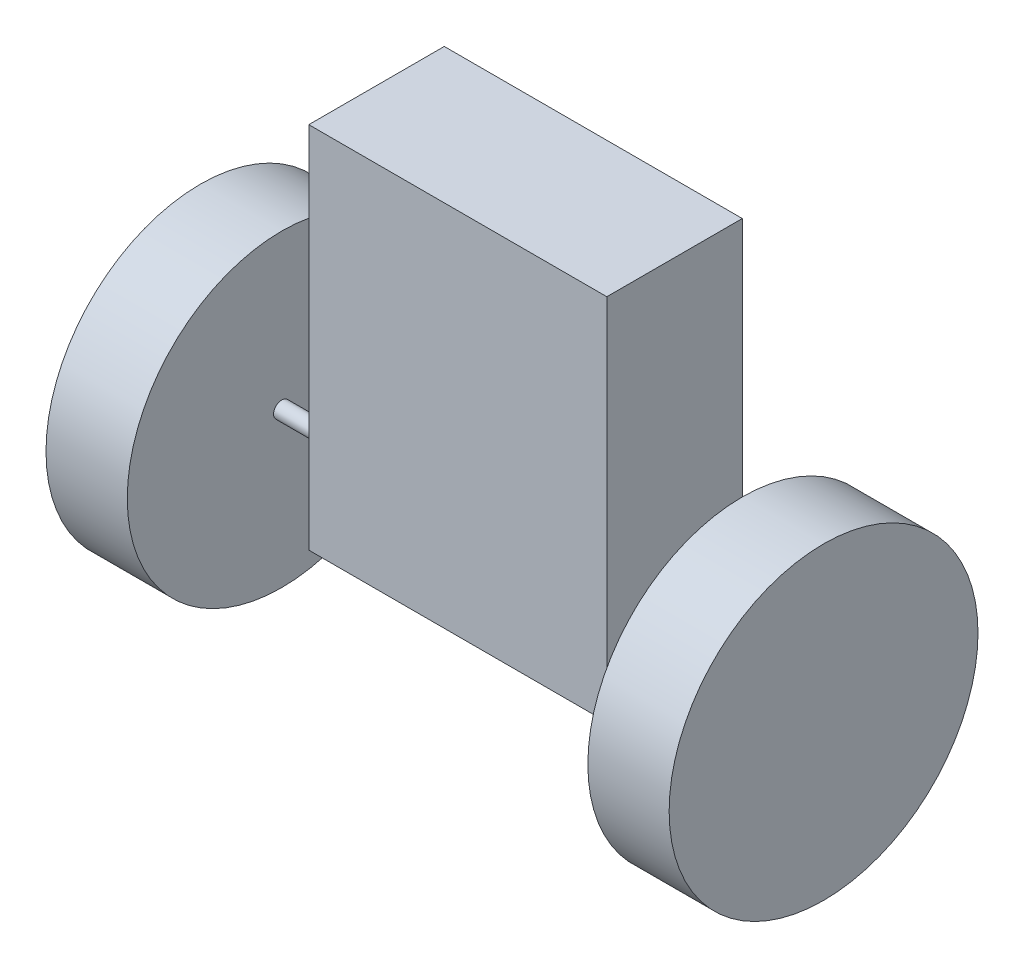
ISO-10303-21;
HEADER;
FILE_DESCRIPTION(('STEP AP214'),'2;1');
FILE_NAME('part.step','',(''),(''),'','','');
FILE_SCHEMA(('AUTOMOTIVE_DESIGN { 1 0 10303 214 1 1 1 1 }'));
ENDSEC;
DATA;
#1=APPLICATION_CONTEXT('core data for automotive mechanical design processes');
#2=APPLICATION_PROTOCOL_DEFINITION('international standard','automotive_design',2000,#1);
#3=PRODUCT_CONTEXT('',#1,'mechanical');
#4=PRODUCT('Part','Part','',(#3));
#5=PRODUCT_RELATED_PRODUCT_CATEGORY('part','',(#4));
#6=PRODUCT_DEFINITION_FORMATION('','',#4);
#7=PRODUCT_DEFINITION_CONTEXT('part definition',#1,'design');
#8=PRODUCT_DEFINITION('design','',#6,#7);
#9=PRODUCT_DEFINITION_SHAPE('','',#8);
#10=(LENGTH_UNIT() NAMED_UNIT(*) SI_UNIT(.MILLI.,.METRE.));
#11=(NAMED_UNIT(*) PLANE_ANGLE_UNIT() SI_UNIT($,.RADIAN.));
#12=(NAMED_UNIT(*) SI_UNIT($,.STERADIAN.) SOLID_ANGLE_UNIT());
#13=UNCERTAINTY_MEASURE_WITH_UNIT(LENGTH_MEASURE(1.E-05),#10,'distance_accuracy_value','');
#14=(GEOMETRIC_REPRESENTATION_CONTEXT(3) GLOBAL_UNCERTAINTY_ASSIGNED_CONTEXT((#13)) GLOBAL_UNIT_ASSIGNED_CONTEXT((#10,
#11,#12)) REPRESENTATION_CONTEXT('',''));
#15=CARTESIAN_POINT('',(0.,0.,0.));
#16=DIRECTION('',(0.,0.,1.));
#17=DIRECTION('',(1.,0.,0.));
#18=AXIS2_PLACEMENT_3D('',#15,#16,#17);
#19=CARTESIAN_POINT('',(27.5,-34.,25.));
#20=DIRECTION('',(-1.,0.,0.));
#21=DIRECTION('',(0.,0.,1.));
#22=AXIS2_PLACEMENT_3D('',#19,#20,#21);
#23=PLANE('',#22);
#24=CARTESIAN_POINT('',(27.5,-24.,15.));
#25=DIRECTION('',(-1.,0.,0.));
#26=DIRECTION('',(0.,0.,1.));
#27=AXIS2_PLACEMENT_3D('',#24,#25,#26);
#28=CIRCLE('',#27,1.5);
#29=CARTESIAN_POINT('',(27.5,-24.,16.5));
#30=VERTEX_POINT('',#29);
#31=EDGE_CURVE('E205',#30,#30,#28,.T.);
#32=ORIENTED_EDGE('',*,*,#31,.T.);
#33=EDGE_LOOP('',(#32));
#34=FACE_BOUND('',#33,.T.);
#35=DIRECTION('',(0.,0.,-1.));
#36=VECTOR('',#35,1.);
#37=CARTESIAN_POINT('',(27.5,-28.4934610358261,2.));
#38=LINE('',#37,#36);
#39=CARTESIAN_POINT('',(27.5,-28.4934610358261,2.));
#40=VERTEX_POINT('',#39);
#41=CARTESIAN_POINT('',(27.5,-28.4934610358261,0.));
#42=VERTEX_POINT('',#41);
#43=EDGE_CURVE('E52',#40,#42,#38,.T.);
#44=ORIENTED_EDGE('',*,*,#43,.F.);
#45=DIRECTION('',(0.,-1.,0.));
#46=VECTOR('',#45,1.);
#47=CARTESIAN_POINT('',(27.5,-28.4934610358261,2.));
#48=LINE('',#47,#46);
#49=CARTESIAN_POINT('',(27.5,-23.4934610358261,2.));
#50=VERTEX_POINT('',#49);
#51=EDGE_CURVE('E47',#50,#40,#48,.T.);
#52=ORIENTED_EDGE('',*,*,#51,.F.);
#53=DIRECTION('',(0.,0.,-1.));
#54=VECTOR('',#53,1.);
#55=CARTESIAN_POINT('',(27.5,-23.4934610358261,2.));
#56=LINE('',#55,#54);
#57=CARTESIAN_POINT('',(27.5,-23.4934610358261,0.));
#58=VERTEX_POINT('',#57);
#59=EDGE_CURVE('E140',#50,#58,#56,.T.);
#60=ORIENTED_EDGE('',*,*,#59,.T.);
#61=DIRECTION('',(0.,1.,0.));
#62=VECTOR('',#61,1.);
#63=CARTESIAN_POINT('',(27.5,-34.,0.));
#64=LINE('',#63,#62);
#65=CARTESIAN_POINT('',(27.5,34.,0.));
#66=VERTEX_POINT('',#65);
#67=EDGE_CURVE('E208',#58,#66,#64,.T.);
#68=ORIENTED_EDGE('',*,*,#67,.T.);
#69=DIRECTION('',(0.,0.,-1.));
#70=VECTOR('',#69,1.);
#71=CARTESIAN_POINT('',(27.5,34.,25.));
#72=LINE('',#71,#70);
#73=CARTESIAN_POINT('',(27.5,34.,25.));
#74=VERTEX_POINT('',#73);
#75=EDGE_CURVE('E236',#74,#66,#72,.T.);
#76=ORIENTED_EDGE('',*,*,#75,.F.);
#77=DIRECTION('',(0.,1.,0.));
#78=VECTOR('',#77,1.);
#79=CARTESIAN_POINT('',(27.5,-34.,25.));
#80=LINE('',#79,#78);
#81=CARTESIAN_POINT('',(27.5,-34.,25.));
#82=VERTEX_POINT('',#81);
#83=EDGE_CURVE('E209',#82,#74,#80,.T.);
#84=ORIENTED_EDGE('',*,*,#83,.F.);
#85=DIRECTION('',(0.,0.,-1.));
#86=VECTOR('',#85,1.);
#87=CARTESIAN_POINT('',(27.5,-34.,25.));
#88=LINE('',#87,#86);
#89=CARTESIAN_POINT('',(27.5,-34.,0.));
#90=VERTEX_POINT('',#89);
#91=EDGE_CURVE('E219',#82,#90,#88,.T.);
#92=ORIENTED_EDGE('',*,*,#91,.T.);
#93=EDGE_CURVE('E220',#90,#42,#64,.T.);
#94=ORIENTED_EDGE('',*,*,#93,.T.);
#95=EDGE_LOOP('',(#44,#52,#60,#68,#76,#84,#92,#94));
#96=FACE_BOUND('',#95,.T.);
#97=ADVANCED_FACE('F32',(#34,#96),#23,.F.);
#98=CARTESIAN_POINT('',(47.5,-24.,15.));
#99=DIRECTION('',(-1.,0.,0.));
#100=DIRECTION('',(0.,0.,1.));
#101=AXIS2_PLACEMENT_3D('',#98,#99,#100);
#102=CYLINDRICAL_SURFACE('',#101,1.5);
#103=ORIENTED_EDGE('',*,*,#31,.F.);
#104=EDGE_LOOP('',(#103));
#105=FACE_BOUND('',#104,.T.);
#106=CARTESIAN_POINT('',(42.5,-24.,15.));
#107=DIRECTION('',(1.,0.,0.));
#108=DIRECTION('',(0.,0.,-1.));
#109=AXIS2_PLACEMENT_3D('',#106,#107,#108);
#110=CIRCLE('',#109,1.5);
#111=CARTESIAN_POINT('',(42.5,-24.,13.5));
#112=VERTEX_POINT('',#111);
#113=EDGE_CURVE('E35',#112,#112,#110,.F.);
#114=ORIENTED_EDGE('',*,*,#113,.T.);
#115=EDGE_LOOP('',(#114));
#116=FACE_BOUND('',#115,.T.);
#117=ADVANCED_FACE('F256',(#105,#116),#102,.T.);
#118=CARTESIAN_POINT('',(-47.5,-24.,15.));
#119=DIRECTION('',(1.,0.,0.));
#120=DIRECTION('',(0.,0.,-1.));
#121=AXIS2_PLACEMENT_3D('',#118,#119,#120);
#122=CYLINDRICAL_SURFACE('',#121,1.5);
#123=CARTESIAN_POINT('',(-27.5,-24.,15.));
#124=DIRECTION('',(1.,0.,0.));
#125=DIRECTION('',(0.,0.,-1.));
#126=AXIS2_PLACEMENT_3D('',#123,#124,#125);
#127=CIRCLE('',#126,1.5);
#128=CARTESIAN_POINT('',(-27.5,-24.,13.5));
#129=VERTEX_POINT('',#128);
#130=EDGE_CURVE('E40',#129,#129,#127,.F.);
#131=ORIENTED_EDGE('',*,*,#130,.T.);
#132=EDGE_LOOP('',(#131));
#133=FACE_BOUND('',#132,.T.);
#134=CARTESIAN_POINT('',(-42.5,-24.,15.));
#135=DIRECTION('',(-1.,0.,0.));
#136=DIRECTION('',(0.,0.,1.));
#137=AXIS2_PLACEMENT_3D('',#134,#135,#136);
#138=CIRCLE('',#137,1.5);
#139=CARTESIAN_POINT('',(-42.5,-24.,16.5));
#140=VERTEX_POINT('',#139);
#141=EDGE_CURVE('E11',#140,#140,#138,.T.);
#142=ORIENTED_EDGE('',*,*,#141,.F.);
#143=EDGE_LOOP('',(#142));
#144=FACE_BOUND('',#143,.T.);
#145=ADVANCED_FACE('F242',(#133,#144),#122,.T.);
#146=CARTESIAN_POINT('',(-27.5,-34.,25.));
#147=DIRECTION('',(1.,0.,0.));
#148=DIRECTION('',(0.,0.,-1.));
#149=AXIS2_PLACEMENT_3D('',#146,#147,#148);
#150=PLANE('',#149);
#151=DIRECTION('',(0.,-1.,0.));
#152=VECTOR('',#151,1.);
#153=CARTESIAN_POINT('',(-27.5,-34.,0.));
#154=LINE('',#153,#152);
#155=CARTESIAN_POINT('',(-27.5,34.,0.));
#156=VERTEX_POINT('',#155);
#157=CARTESIAN_POINT('',(-27.5,-23.4934610358261,0.));
#158=VERTEX_POINT('',#157);
#159=EDGE_CURVE('E225',#156,#158,#154,.T.);
#160=ORIENTED_EDGE('',*,*,#159,.T.);
#161=DIRECTION('',(0.,0.,-1.));
#162=VECTOR('',#161,1.);
#163=CARTESIAN_POINT('',(-27.5,-23.4934610358261,2.));
#164=LINE('',#163,#162);
#165=CARTESIAN_POINT('',(-27.5,-23.4934610358261,2.));
#166=VERTEX_POINT('',#165);
#167=EDGE_CURVE('E184',#166,#158,#164,.T.);
#168=ORIENTED_EDGE('',*,*,#167,.F.);
#169=DIRECTION('',(0.,-1.,0.));
#170=VECTOR('',#169,1.);
#171=CARTESIAN_POINT('',(-27.5,-28.4934610358261,2.));
#172=LINE('',#171,#170);
#173=CARTESIAN_POINT('',(-27.5,-28.4934610358261,2.));
#174=VERTEX_POINT('',#173);
#175=EDGE_CURVE('E164',#166,#174,#172,.T.);
#176=ORIENTED_EDGE('',*,*,#175,.T.);
#177=DIRECTION('',(0.,0.,-1.));
#178=VECTOR('',#177,1.);
#179=CARTESIAN_POINT('',(-27.5,-28.4934610358261,2.));
#180=LINE('',#179,#178);
#181=CARTESIAN_POINT('',(-27.5,-28.4934610358261,0.));
#182=VERTEX_POINT('',#181);
#183=EDGE_CURVE('E176',#174,#182,#180,.T.);
#184=ORIENTED_EDGE('',*,*,#183,.T.);
#185=CARTESIAN_POINT('',(-27.5,-34.,0.));
#186=VERTEX_POINT('',#185);
#187=EDGE_CURVE('E224',#182,#186,#154,.T.);
#188=ORIENTED_EDGE('',*,*,#187,.T.);
#189=DIRECTION('',(0.,0.,-1.));
#190=VECTOR('',#189,1.);
#191=CARTESIAN_POINT('',(-27.5,-34.,25.));
#192=LINE('',#191,#190);
#193=CARTESIAN_POINT('',(-27.5,-34.,25.));
#194=VERTEX_POINT('',#193);
#195=EDGE_CURVE('E230',#194,#186,#192,.T.);
#196=ORIENTED_EDGE('',*,*,#195,.F.);
#197=DIRECTION('',(0.,-1.,0.));
#198=VECTOR('',#197,1.);
#199=CARTESIAN_POINT('',(-27.5,-34.,25.));
#200=LINE('',#199,#198);
#201=CARTESIAN_POINT('',(-27.5,34.,25.));
#202=VERTEX_POINT('',#201);
#203=EDGE_CURVE('E215',#202,#194,#200,.T.);
#204=ORIENTED_EDGE('',*,*,#203,.F.);
#205=DIRECTION('',(0.,0.,-1.));
#206=VECTOR('',#205,1.);
#207=CARTESIAN_POINT('',(-27.5,34.,25.));
#208=LINE('',#207,#206);
#209=EDGE_CURVE('E233',#202,#156,#208,.T.);
#210=ORIENTED_EDGE('',*,*,#209,.T.);
#211=EDGE_LOOP('',(#160,#168,#176,#184,#188,#196,#204,#210));
#212=FACE_BOUND('',#211,.T.);
#213=ORIENTED_EDGE('',*,*,#130,.F.);
#214=EDGE_LOOP('',(#213));
#215=FACE_BOUND('',#214,.T.);
#216=ADVANCED_FACE('F245',(#212,#215),#150,.F.);
#217=CARTESIAN_POINT('',(-27.5,34.,25.));
#218=DIRECTION('',(0.,-1.,0.));
#219=DIRECTION('',(0.,0.,-1.));
#220=AXIS2_PLACEMENT_3D('',#217,#218,#219);
#221=PLANE('',#220);
#222=DIRECTION('',(-1.,0.,0.));
#223=VECTOR('',#222,1.);
#224=CARTESIAN_POINT('',(-27.5,34.,0.));
#225=LINE('',#224,#223);
#226=EDGE_CURVE('E222',#66,#156,#225,.T.);
#227=ORIENTED_EDGE('',*,*,#226,.T.);
#228=ORIENTED_EDGE('',*,*,#209,.F.);
#229=DIRECTION('',(-1.,0.,0.));
#230=VECTOR('',#229,1.);
#231=CARTESIAN_POINT('',(-27.5,34.,25.));
#232=LINE('',#231,#230);
#233=EDGE_CURVE('E212',#74,#202,#232,.T.);
#234=ORIENTED_EDGE('',*,*,#233,.F.);
#235=ORIENTED_EDGE('',*,*,#75,.T.);
#236=EDGE_LOOP('',(#227,#228,#234,#235));
#237=FACE_BOUND('',#236,.T.);
#238=ADVANCED_FACE('F247',(#237),#221,.F.);
#239=CARTESIAN_POINT('',(-27.5,-34.,25.));
#240=DIRECTION('',(0.,1.,0.));
#241=DIRECTION('',(0.,0.,1.));
#242=AXIS2_PLACEMENT_3D('',#239,#240,#241);
#243=PLANE('',#242);
#244=DIRECTION('',(1.,0.,0.));
#245=VECTOR('',#244,1.);
#246=CARTESIAN_POINT('',(-27.5,-34.,0.));
#247=LINE('',#246,#245);
#248=EDGE_CURVE('E213',#186,#90,#247,.T.);
#249=ORIENTED_EDGE('',*,*,#248,.T.);
#250=ORIENTED_EDGE('',*,*,#91,.F.);
#251=DIRECTION('',(1.,0.,0.));
#252=VECTOR('',#251,1.);
#253=CARTESIAN_POINT('',(-27.5,-34.,25.));
#254=LINE('',#253,#252);
#255=EDGE_CURVE('E217',#194,#82,#254,.T.);
#256=ORIENTED_EDGE('',*,*,#255,.F.);
#257=ORIENTED_EDGE('',*,*,#195,.T.);
#258=EDGE_LOOP('',(#249,#250,#256,#257));
#259=FACE_BOUND('',#258,.T.);
#260=ADVANCED_FACE('F254',(#259),#243,.F.);
#261=CARTESIAN_POINT('',(0.,0.,25.));
#262=DIRECTION('',(0.,0.,-1.));
#263=DIRECTION('',(-1.,0.,0.));
#264=AXIS2_PLACEMENT_3D('',#261,#262,#263);
#265=PLANE('',#264);
#266=ORIENTED_EDGE('',*,*,#83,.T.);
#267=ORIENTED_EDGE('',*,*,#233,.T.);
#268=ORIENTED_EDGE('',*,*,#203,.T.);
#269=ORIENTED_EDGE('',*,*,#255,.T.);
#270=EDGE_LOOP('',(#266,#267,#268,#269));
#271=FACE_BOUND('',#270,.T.);
#272=ADVANCED_FACE('F310',(#271),#265,.F.);
#273=CARTESIAN_POINT('',(0.,0.,0.));
#274=DIRECTION('',(0.,0.,-1.));
#275=DIRECTION('',(-1.,0.,0.));
#276=AXIS2_PLACEMENT_3D('',#273,#274,#275);
#277=PLANE('',#276);
#278=CARTESIAN_POINT('',(30.,-25.9934610358261,0.));
#279=DIRECTION('',(0.,0.,-1.));
#280=DIRECTION('',(-1.,0.,0.));
#281=AXIS2_PLACEMENT_3D('',#278,#279,#280);
#282=CIRCLE('',#281,1.69999999999999);
#283=CARTESIAN_POINT('',(28.3,-25.9934610358261,0.));
#284=VERTEX_POINT('',#283);
#285=EDGE_CURVE('E431',#284,#284,#282,.T.);
#286=ORIENTED_EDGE('',*,*,#285,.F.);
#287=EDGE_LOOP('',(#286));
#288=FACE_BOUND('',#287,.T.);
#289=CARTESIAN_POINT('',(-30.,-25.9934610358261,0.));
#290=DIRECTION('',(0.,0.,-1.));
#291=DIRECTION('',(-1.,0.,0.));
#292=AXIS2_PLACEMENT_3D('',#289,#290,#291);
#293=CIRCLE('',#292,1.69999999999999);
#294=CARTESIAN_POINT('',(-31.7,-25.9934610358261,0.));
#295=VERTEX_POINT('',#294);
#296=EDGE_CURVE('E155',#295,#295,#293,.T.);
#297=ORIENTED_EDGE('',*,*,#296,.F.);
#298=EDGE_LOOP('',(#297));
#299=FACE_BOUND('',#298,.T.);
#300=ORIENTED_EDGE('',*,*,#93,.F.);
#301=ORIENTED_EDGE('',*,*,#248,.F.);
#302=ORIENTED_EDGE('',*,*,#187,.F.);
#303=DIRECTION('',(-1.,0.,0.));
#304=VECTOR('',#303,1.);
#305=CARTESIAN_POINT('',(-32.5,-28.4934610358261,0.));
#306=LINE('',#305,#304);
#307=CARTESIAN_POINT('',(-32.5,-28.4934610358261,0.));
#308=VERTEX_POINT('',#307);
#309=EDGE_CURVE('E163',#182,#308,#306,.T.);
#310=ORIENTED_EDGE('',*,*,#309,.T.);
#311=DIRECTION('',(0.,1.,0.));
#312=VECTOR('',#311,1.);
#313=CARTESIAN_POINT('',(-32.5,-23.4934610358261,0.));
#314=LINE('',#313,#312);
#315=CARTESIAN_POINT('',(-32.5,-23.4934610358261,0.));
#316=VERTEX_POINT('',#315);
#317=EDGE_CURVE('E179',#308,#316,#314,.T.);
#318=ORIENTED_EDGE('',*,*,#317,.T.);
#319=DIRECTION('',(1.,0.,0.));
#320=VECTOR('',#319,1.);
#321=CARTESIAN_POINT('',(-27.5,-23.4934610358261,0.));
#322=LINE('',#321,#320);
#323=EDGE_CURVE('E167',#316,#158,#322,.T.);
#324=ORIENTED_EDGE('',*,*,#323,.T.);
#325=ORIENTED_EDGE('',*,*,#159,.F.);
#326=ORIENTED_EDGE('',*,*,#226,.F.);
#327=ORIENTED_EDGE('',*,*,#67,.F.);
#328=DIRECTION('',(-1.,0.,0.));
#329=VECTOR('',#328,1.);
#330=CARTESIAN_POINT('',(27.5,-23.4934610358261,0.));
#331=LINE('',#330,#329);
#332=CARTESIAN_POINT('',(32.5,-23.4934610358261,0.));
#333=VERTEX_POINT('',#332);
#334=EDGE_CURVE('E149',#333,#58,#331,.T.);
#335=ORIENTED_EDGE('',*,*,#334,.F.);
#336=DIRECTION('',(0.,1.,0.));
#337=VECTOR('',#336,1.);
#338=CARTESIAN_POINT('',(32.5,-23.4934610358261,0.));
#339=LINE('',#338,#337);
#340=CARTESIAN_POINT('',(32.5,-28.4934610358261,0.));
#341=VERTEX_POINT('',#340);
#342=EDGE_CURVE('E135',#341,#333,#339,.T.);
#343=ORIENTED_EDGE('',*,*,#342,.F.);
#344=DIRECTION('',(1.,0.,0.));
#345=VECTOR('',#344,1.);
#346=CARTESIAN_POINT('',(32.5,-28.4934610358261,0.));
#347=LINE('',#346,#345);
#348=EDGE_CURVE('E144',#42,#341,#347,.T.);
#349=ORIENTED_EDGE('',*,*,#348,.F.);
#350=EDGE_LOOP('',(#300,#301,#302,#310,#318,#324,#325,#326,#327,#335,#343,#349));
#351=FACE_BOUND('',#350,.T.);
#352=ADVANCED_FACE('F305',(#288,#299,#351),#277,.T.);
#353=CARTESIAN_POINT('',(-42.5,-24.,15.));
#354=DIRECTION('',(-1.,0.,0.));
#355=DIRECTION('',(0.,0.,1.));
#356=AXIS2_PLACEMENT_3D('',#353,#354,#355);
#357=PLANE('',#356);
#358=CARTESIAN_POINT('',(-42.5,-24.,15.));
#359=DIRECTION('',(-1.,0.,0.));
#360=DIRECTION('',(0.,0.,1.));
#361=AXIS2_PLACEMENT_3D('',#358,#359,#360);
#362=CIRCLE('',#361,28.5);
#363=CARTESIAN_POINT('',(-42.5,-24.,43.5));
#364=VERTEX_POINT('',#363);
#365=EDGE_CURVE('E202',#364,#364,#362,.T.);
#366=ORIENTED_EDGE('',*,*,#365,.F.);
#367=EDGE_LOOP('',(#366));
#368=FACE_BOUND('',#367,.T.);
#369=ORIENTED_EDGE('',*,*,#141,.T.);
#370=EDGE_LOOP('',(#369));
#371=FACE_BOUND('',#370,.T.);
#372=ADVANCED_FACE('F302',(#368,#371),#357,.F.);
#373=CARTESIAN_POINT('',(-42.5,-24.,15.));
#374=DIRECTION('',(-1.,0.,0.));
#375=DIRECTION('',(0.,0.,1.));
#376=AXIS2_PLACEMENT_3D('',#373,#374,#375);
#377=CYLINDRICAL_SURFACE('',#376,28.5);
#378=ORIENTED_EDGE('',*,*,#365,.T.);
#379=EDGE_LOOP('',(#378));
#380=FACE_BOUND('',#379,.T.);
#381=CARTESIAN_POINT('',(-57.5,-24.,15.));
#382=DIRECTION('',(-1.,0.,0.));
#383=DIRECTION('',(0.,0.,1.));
#384=AXIS2_PLACEMENT_3D('',#381,#382,#383);
#385=CIRCLE('',#384,28.5);
#386=CARTESIAN_POINT('',(-57.5,-24.,43.5));
#387=VERTEX_POINT('',#386);
#388=EDGE_CURVE('E199',#387,#387,#385,.T.);
#389=ORIENTED_EDGE('',*,*,#388,.F.);
#390=EDGE_LOOP('',(#389));
#391=FACE_BOUND('',#390,.T.);
#392=ADVANCED_FACE('F300',(#380,#391),#377,.T.);
#393=CARTESIAN_POINT('',(-57.5,-24.,15.));
#394=DIRECTION('',(-1.,0.,0.));
#395=DIRECTION('',(0.,0.,1.));
#396=AXIS2_PLACEMENT_3D('',#393,#394,#395);
#397=PLANE('',#396);
#398=ORIENTED_EDGE('',*,*,#388,.T.);
#399=EDGE_LOOP('',(#398));
#400=FACE_BOUND('',#399,.T.);
#401=ADVANCED_FACE('F281',(#400),#397,.T.);
#402=CARTESIAN_POINT('',(42.5,-24.,15.));
#403=DIRECTION('',(1.,0.,0.));
#404=DIRECTION('',(0.,0.,-1.));
#405=AXIS2_PLACEMENT_3D('',#402,#403,#404);
#406=CYLINDRICAL_SURFACE('',#405,28.5);
#407=CARTESIAN_POINT('',(42.5,-24.,15.));
#408=DIRECTION('',(-1.,0.,0.));
#409=DIRECTION('',(0.,0.,1.));
#410=AXIS2_PLACEMENT_3D('',#407,#408,#409);
#411=CIRCLE('',#410,28.5);
#412=CARTESIAN_POINT('',(42.5,-24.,43.5));
#413=VERTEX_POINT('',#412);
#414=EDGE_CURVE('E196',#413,#413,#411,.T.);
#415=ORIENTED_EDGE('',*,*,#414,.F.);
#416=EDGE_LOOP('',(#415));
#417=FACE_BOUND('',#416,.T.);
#418=CARTESIAN_POINT('',(57.5,-24.,15.));
#419=DIRECTION('',(-1.,0.,0.));
#420=DIRECTION('',(0.,0.,1.));
#421=AXIS2_PLACEMENT_3D('',#418,#419,#420);
#422=CIRCLE('',#421,28.5);
#423=CARTESIAN_POINT('',(57.5,-24.,43.5));
#424=VERTEX_POINT('',#423);
#425=EDGE_CURVE('E187',#424,#424,#422,.T.);
#426=ORIENTED_EDGE('',*,*,#425,.T.);
#427=EDGE_LOOP('',(#426));
#428=FACE_BOUND('',#427,.T.);
#429=ADVANCED_FACE('F275',(#417,#428),#406,.T.);
#430=CARTESIAN_POINT('',(42.5,-24.,15.));
#431=DIRECTION('',(1.,0.,0.));
#432=DIRECTION('',(0.,0.,1.));
#433=AXIS2_PLACEMENT_3D('',#430,#431,#432);
#434=PLANE('',#433);
#435=ORIENTED_EDGE('',*,*,#113,.F.);
#436=EDGE_LOOP('',(#435));
#437=FACE_BOUND('',#436,.T.);
#438=ORIENTED_EDGE('',*,*,#414,.T.);
#439=EDGE_LOOP('',(#438));
#440=FACE_BOUND('',#439,.T.);
#441=ADVANCED_FACE('F271',(#437,#440),#434,.F.);
#442=CARTESIAN_POINT('',(57.5,-24.,15.));
#443=DIRECTION('',(1.,0.,0.));
#444=DIRECTION('',(0.,0.,1.));
#445=AXIS2_PLACEMENT_3D('',#442,#443,#444);
#446=PLANE('',#445);
#447=ORIENTED_EDGE('',*,*,#425,.F.);
#448=EDGE_LOOP('',(#447));
#449=FACE_BOUND('',#448,.T.);
#450=ADVANCED_FACE('F274',(#449),#446,.T.);
#451=CARTESIAN_POINT('',(-27.5,-23.4934610358261,2.));
#452=DIRECTION('',(0.,1.,0.));
#453=DIRECTION('',(-1.,0.,0.));
#454=AXIS2_PLACEMENT_3D('',#451,#452,#453);
#455=PLANE('',#454);
#456=ORIENTED_EDGE('',*,*,#323,.F.);
#457=DIRECTION('',(0.,0.,-1.));
#458=VECTOR('',#457,1.);
#459=CARTESIAN_POINT('',(-32.5,-23.4934610358261,2.));
#460=LINE('',#459,#458);
#461=CARTESIAN_POINT('',(-32.5,-23.4934610358261,2.));
#462=VERTEX_POINT('',#461);
#463=EDGE_CURVE('E188',#462,#316,#460,.T.);
#464=ORIENTED_EDGE('',*,*,#463,.F.);
#465=DIRECTION('',(1.,0.,0.));
#466=VECTOR('',#465,1.);
#467=CARTESIAN_POINT('',(-27.5,-23.4934610358261,2.));
#468=LINE('',#467,#466);
#469=EDGE_CURVE('E173',#462,#166,#468,.T.);
#470=ORIENTED_EDGE('',*,*,#469,.T.);
#471=ORIENTED_EDGE('',*,*,#167,.T.);
#472=EDGE_LOOP('',(#456,#464,#470,#471));
#473=FACE_BOUND('',#472,.T.);
#474=ADVANCED_FACE('F286',(#473),#455,.T.);
#475=CARTESIAN_POINT('',(-32.5,-23.4934610358261,2.));
#476=DIRECTION('',(-1.,0.,0.));
#477=DIRECTION('',(0.,-1.,0.));
#478=AXIS2_PLACEMENT_3D('',#475,#476,#477);
#479=PLANE('',#478);
#480=ORIENTED_EDGE('',*,*,#317,.F.);
#481=DIRECTION('',(0.,0.,-1.));
#482=VECTOR('',#481,1.);
#483=CARTESIAN_POINT('',(-32.5,-28.4934610358261,2.));
#484=LINE('',#483,#482);
#485=CARTESIAN_POINT('',(-32.5,-28.4934610358261,2.));
#486=VERTEX_POINT('',#485);
#487=EDGE_CURVE('E190',#486,#308,#484,.T.);
#488=ORIENTED_EDGE('',*,*,#487,.F.);
#489=DIRECTION('',(0.,1.,0.));
#490=VECTOR('',#489,1.);
#491=CARTESIAN_POINT('',(-32.5,-23.4934610358261,2.));
#492=LINE('',#491,#490);
#493=EDGE_CURVE('E170',#486,#462,#492,.T.);
#494=ORIENTED_EDGE('',*,*,#493,.T.);
#495=ORIENTED_EDGE('',*,*,#463,.T.);
#496=EDGE_LOOP('',(#480,#488,#494,#495));
#497=FACE_BOUND('',#496,.T.);
#498=ADVANCED_FACE('F291',(#497),#479,.T.);
#499=CARTESIAN_POINT('',(-32.5,-28.4934610358261,2.));
#500=DIRECTION('',(0.,-1.,0.));
#501=DIRECTION('',(0.,0.,-1.));
#502=AXIS2_PLACEMENT_3D('',#499,#500,#501);
#503=PLANE('',#502);
#504=ORIENTED_EDGE('',*,*,#309,.F.);
#505=ORIENTED_EDGE('',*,*,#183,.F.);
#506=DIRECTION('',(-1.,0.,0.));
#507=VECTOR('',#506,1.);
#508=CARTESIAN_POINT('',(-32.5,-28.4934610358261,2.));
#509=LINE('',#508,#507);
#510=EDGE_CURVE('E166',#174,#486,#509,.T.);
#511=ORIENTED_EDGE('',*,*,#510,.T.);
#512=ORIENTED_EDGE('',*,*,#487,.T.);
#513=EDGE_LOOP('',(#504,#505,#511,#512));
#514=FACE_BOUND('',#513,.T.);
#515=ADVANCED_FACE('F295',(#514),#503,.T.);
#516=CARTESIAN_POINT('',(0.,0.,2.));
#517=DIRECTION('',(0.,0.,1.));
#518=DIRECTION('',(1.,0.,0.));
#519=AXIS2_PLACEMENT_3D('',#516,#517,#518);
#520=PLANE('',#519);
#521=CARTESIAN_POINT('',(-30.,-25.9934610358261,2.));
#522=DIRECTION('',(0.,0.,1.));
#523=DIRECTION('',(1.,0.,0.));
#524=AXIS2_PLACEMENT_3D('',#521,#522,#523);
#525=CIRCLE('',#524,1.69999999999999);
#526=CARTESIAN_POINT('',(-28.3,-25.9934610358261,2.));
#527=VERTEX_POINT('',#526);
#528=EDGE_CURVE('E160',#527,#527,#525,.T.);
#529=ORIENTED_EDGE('',*,*,#528,.F.);
#530=EDGE_LOOP('',(#529));
#531=FACE_BOUND('',#530,.T.);
#532=ORIENTED_EDGE('',*,*,#175,.F.);
#533=ORIENTED_EDGE('',*,*,#469,.F.);
#534=ORIENTED_EDGE('',*,*,#493,.F.);
#535=ORIENTED_EDGE('',*,*,#510,.F.);
#536=EDGE_LOOP('',(#532,#533,#534,#535));
#537=FACE_BOUND('',#536,.T.);
#538=ADVANCED_FACE('F339',(#531,#537),#520,.T.);
#539=CARTESIAN_POINT('',(-30.,-25.9934610358261,0.));
#540=DIRECTION('',(0.,0.,-1.));
#541=DIRECTION('',(-1.,0.,0.));
#542=AXIS2_PLACEMENT_3D('',#539,#540,#541);
#543=CYLINDRICAL_SURFACE('',#542,1.69999999999999);
#544=ORIENTED_EDGE('',*,*,#528,.T.);
#545=EDGE_LOOP('',(#544));
#546=FACE_BOUND('',#545,.T.);
#547=ORIENTED_EDGE('',*,*,#296,.T.);
#548=EDGE_LOOP('',(#547));
#549=FACE_BOUND('',#548,.T.);
#550=ADVANCED_FACE('F332',(#546,#549),#543,.F.);
#551=CARTESIAN_POINT('',(32.5,-28.4934610358261,2.));
#552=DIRECTION('',(0.,1.,0.));
#553=DIRECTION('',(0.,0.,1.));
#554=AXIS2_PLACEMENT_3D('',#551,#552,#553);
#555=PLANE('',#554);
#556=ORIENTED_EDGE('',*,*,#348,.T.);
#557=DIRECTION('',(0.,0.,-1.));
#558=VECTOR('',#557,1.);
#559=CARTESIAN_POINT('',(32.5,-28.4934610358261,2.));
#560=LINE('',#559,#558);
#561=CARTESIAN_POINT('',(32.5,-28.4934610358261,2.));
#562=VERTEX_POINT('',#561);
#563=EDGE_CURVE('E139',#562,#341,#560,.T.);
#564=ORIENTED_EDGE('',*,*,#563,.F.);
#565=DIRECTION('',(1.,0.,0.));
#566=VECTOR('',#565,1.);
#567=CARTESIAN_POINT('',(32.5,-28.4934610358261,2.));
#568=LINE('',#567,#566);
#569=EDGE_CURVE('E126',#40,#562,#568,.T.);
#570=ORIENTED_EDGE('',*,*,#569,.F.);
#571=ORIENTED_EDGE('',*,*,#43,.T.);
#572=EDGE_LOOP('',(#556,#564,#570,#571));
#573=FACE_BOUND('',#572,.T.);
#574=ADVANCED_FACE('F330',(#573),#555,.F.);
#575=CARTESIAN_POINT('',(32.5,-23.4934610358261,2.));
#576=DIRECTION('',(-1.,0.,0.));
#577=DIRECTION('',(0.,-1.,0.));
#578=AXIS2_PLACEMENT_3D('',#575,#576,#577);
#579=PLANE('',#578);
#580=ORIENTED_EDGE('',*,*,#342,.T.);
#581=DIRECTION('',(0.,0.,-1.));
#582=VECTOR('',#581,1.);
#583=CARTESIAN_POINT('',(32.5,-23.4934610358261,2.));
#584=LINE('',#583,#582);
#585=CARTESIAN_POINT('',(32.5,-23.4934610358261,2.));
#586=VERTEX_POINT('',#585);
#587=EDGE_CURVE('E132',#586,#333,#584,.T.);
#588=ORIENTED_EDGE('',*,*,#587,.F.);
#589=DIRECTION('',(0.,1.,0.));
#590=VECTOR('',#589,1.);
#591=CARTESIAN_POINT('',(32.5,-23.4934610358261,2.));
#592=LINE('',#591,#590);
#593=EDGE_CURVE('E120',#562,#586,#592,.T.);
#594=ORIENTED_EDGE('',*,*,#593,.F.);
#595=ORIENTED_EDGE('',*,*,#563,.T.);
#596=EDGE_LOOP('',(#580,#588,#594,#595));
#597=FACE_BOUND('',#596,.T.);
#598=ADVANCED_FACE('F133',(#597),#579,.F.);
#599=CARTESIAN_POINT('',(27.5,-23.4934610358261,2.));
#600=DIRECTION('',(0.,-1.,0.));
#601=DIRECTION('',(1.,0.,0.));
#602=AXIS2_PLACEMENT_3D('',#599,#600,#601);
#603=PLANE('',#602);
#604=ORIENTED_EDGE('',*,*,#334,.T.);
#605=ORIENTED_EDGE('',*,*,#59,.F.);
#606=DIRECTION('',(-1.,0.,0.));
#607=VECTOR('',#606,1.);
#608=CARTESIAN_POINT('',(27.5,-23.4934610358261,2.));
#609=LINE('',#608,#607);
#610=EDGE_CURVE('E124',#586,#50,#609,.T.);
#611=ORIENTED_EDGE('',*,*,#610,.F.);
#612=ORIENTED_EDGE('',*,*,#587,.T.);
#613=EDGE_LOOP('',(#604,#605,#611,#612));
#614=FACE_BOUND('',#613,.T.);
#615=ADVANCED_FACE('F142',(#614),#603,.F.);
#616=CARTESIAN_POINT('',(0.,0.,2.));
#617=DIRECTION('',(0.,0.,1.));
#618=DIRECTION('',(-1.,0.,0.));
#619=AXIS2_PLACEMENT_3D('',#616,#617,#618);
#620=PLANE('',#619);
#621=CARTESIAN_POINT('',(30.,-25.9934610358261,2.));
#622=DIRECTION('',(0.,0.,1.));
#623=DIRECTION('',(1.,0.,0.));
#624=AXIS2_PLACEMENT_3D('',#621,#622,#623);
#625=CIRCLE('',#624,1.69999999999999);
#626=CARTESIAN_POINT('',(31.7,-25.9934610358261,2.));
#627=VERTEX_POINT('',#626);
#628=EDGE_CURVE('E151',#627,#627,#625,.T.);
#629=ORIENTED_EDGE('',*,*,#628,.F.);
#630=EDGE_LOOP('',(#629));
#631=FACE_BOUND('',#630,.T.);
#632=ORIENTED_EDGE('',*,*,#51,.T.);
#633=ORIENTED_EDGE('',*,*,#569,.T.);
#634=ORIENTED_EDGE('',*,*,#593,.T.);
#635=ORIENTED_EDGE('',*,*,#610,.T.);
#636=EDGE_LOOP('',(#632,#633,#634,#635));
#637=FACE_BOUND('',#636,.T.);
#638=ADVANCED_FACE('F122',(#631,#637),#620,.T.);
#639=CARTESIAN_POINT('',(30.,-25.9934610358261,0.));
#640=DIRECTION('',(0.,0.,-1.));
#641=DIRECTION('',(-1.,0.,0.));
#642=AXIS2_PLACEMENT_3D('',#639,#640,#641);
#643=CYLINDRICAL_SURFACE('',#642,1.69999999999999);
#644=ORIENTED_EDGE('',*,*,#628,.T.);
#645=EDGE_LOOP('',(#644));
#646=FACE_BOUND('',#645,.T.);
#647=ORIENTED_EDGE('',*,*,#285,.T.);
#648=EDGE_LOOP('',(#647));
#649=FACE_BOUND('',#648,.T.);
#650=ADVANCED_FACE('F414',(#646,#649),#643,.F.);
#651=CLOSED_SHELL('',(#97,#117,#145,#216,#238,#260,#272,#352,#372,#392,#401,#429,#441,#450,#474,
#498,#515,#538,#550,#574,#598,#615,#638,#650));
#652=MANIFOLD_SOLID_BREP('B2',#651);
#653=ADVANCED_BREP_SHAPE_REPRESENTATION('',(#18,#652),#14);
#654=SHAPE_DEFINITION_REPRESENTATION(#9,#653);
ENDSEC;
END-ISO-10303-21;
